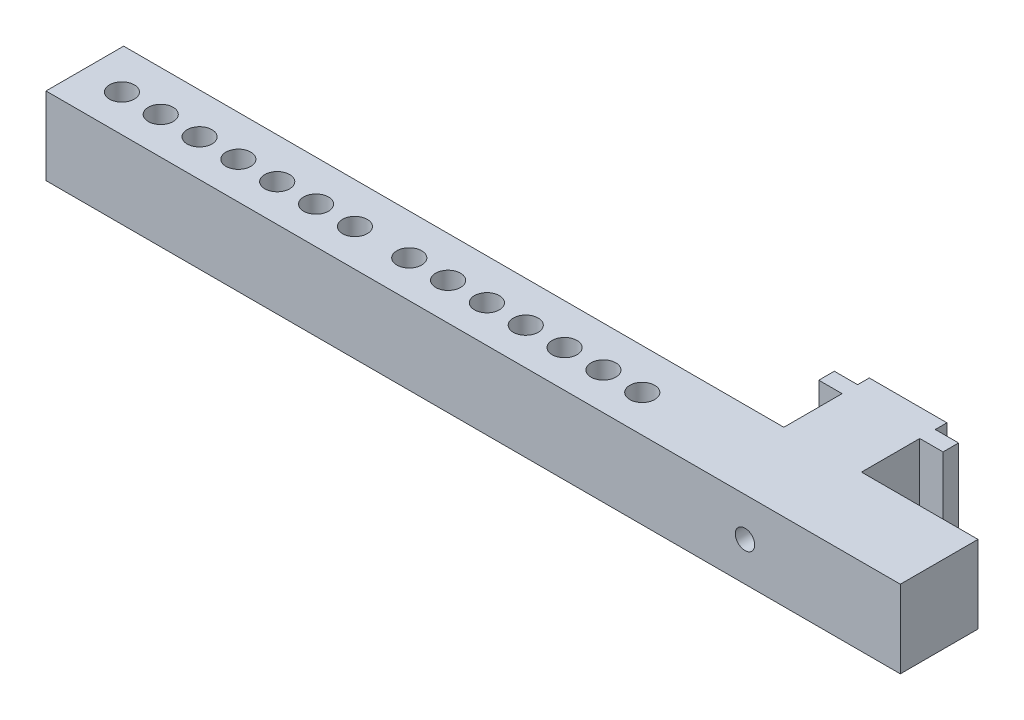
ISO-10303-21;
HEADER;
FILE_DESCRIPTION(('STEP AP214'),'2;1');
FILE_NAME('part.step','',(''),(''),'','','');
FILE_SCHEMA(('AUTOMOTIVE_DESIGN { 1 0 10303 214 1 1 1 1 }'));
ENDSEC;
DATA;
#1=APPLICATION_CONTEXT('core data for automotive mechanical design processes');
#2=APPLICATION_PROTOCOL_DEFINITION('international standard','automotive_design',2000,#1);
#3=PRODUCT_CONTEXT('',#1,'mechanical');
#4=PRODUCT('Part','Part','',(#3));
#5=PRODUCT_RELATED_PRODUCT_CATEGORY('part','',(#4));
#6=PRODUCT_DEFINITION_FORMATION('','',#4);
#7=PRODUCT_DEFINITION_CONTEXT('part definition',#1,'design');
#8=PRODUCT_DEFINITION('design','',#6,#7);
#9=PRODUCT_DEFINITION_SHAPE('','',#8);
#10=(LENGTH_UNIT() NAMED_UNIT(*) SI_UNIT(.MILLI.,.METRE.));
#11=(NAMED_UNIT(*) PLANE_ANGLE_UNIT() SI_UNIT($,.RADIAN.));
#12=(NAMED_UNIT(*) SI_UNIT($,.STERADIAN.) SOLID_ANGLE_UNIT());
#13=UNCERTAINTY_MEASURE_WITH_UNIT(LENGTH_MEASURE(1.E-05),#10,'distance_accuracy_value','');
#14=(GEOMETRIC_REPRESENTATION_CONTEXT(3) GLOBAL_UNCERTAINTY_ASSIGNED_CONTEXT((#13)) GLOBAL_UNIT_ASSIGNED_CONTEXT((#10,
#11,#12)) REPRESENTATION_CONTEXT('',''));
#15=CARTESIAN_POINT('',(0.,0.,0.));
#16=DIRECTION('',(0.,0.,1.));
#17=DIRECTION('',(1.,0.,0.));
#18=AXIS2_PLACEMENT_3D('',#15,#16,#17);
#19=CARTESIAN_POINT('',(5.,5.,11.));
#20=DIRECTION('',(-1.,0.,0.));
#21=DIRECTION('',(0.,0.,1.));
#22=AXIS2_PLACEMENT_3D('',#19,#20,#21);
#23=PLANE('',#22);
#24=DIRECTION('',(0.,0.,-1.));
#25=VECTOR('',#24,1.);
#26=CARTESIAN_POINT('',(5.,5.,11.));
#27=LINE('',#26,#25);
#28=CARTESIAN_POINT('',(5.,5.,1.5));
#29=VERTEX_POINT('',#28);
#30=CARTESIAN_POINT('',(5.,5.,0.));
#31=VERTEX_POINT('',#30);
#32=EDGE_CURVE('E41',#29,#31,#27,.T.);
#33=ORIENTED_EDGE('',*,*,#32,.F.);
#34=DIRECTION('',(0.,-1.,0.));
#35=VECTOR('',#34,1.);
#36=CARTESIAN_POINT('',(5.,5.,1.5));
#37=LINE('',#36,#35);
#38=CARTESIAN_POINT('',(5.,-5.,1.5));
#39=VERTEX_POINT('',#38);
#40=EDGE_CURVE('E247',#29,#39,#37,.T.);
#41=ORIENTED_EDGE('',*,*,#40,.T.);
#42=DIRECTION('',(0.,0.,-1.));
#43=VECTOR('',#42,1.);
#44=CARTESIAN_POINT('',(5.,-5.,11.));
#45=LINE('',#44,#43);
#46=CARTESIAN_POINT('',(5.,-5.,0.));
#47=VERTEX_POINT('',#46);
#48=EDGE_CURVE('E256',#39,#47,#45,.T.);
#49=ORIENTED_EDGE('',*,*,#48,.T.);
#50=DIRECTION('',(0.,1.,0.));
#51=VECTOR('',#50,1.);
#52=CARTESIAN_POINT('',(5.,5.,0.));
#53=LINE('',#52,#51);
#54=EDGE_CURVE('E250',#47,#31,#53,.T.);
#55=ORIENTED_EDGE('',*,*,#54,.T.);
#56=EDGE_LOOP('',(#33,#41,#49,#55));
#57=FACE_BOUND('',#56,.T.);
#58=ADVANCED_FACE('F33',(#57),#23,.F.);
#59=CARTESIAN_POINT('',(-5.,5.,11.));
#60=DIRECTION('',(1.,0.,0.));
#61=DIRECTION('',(0.,0.,-1.));
#62=AXIS2_PLACEMENT_3D('',#59,#60,#61);
#63=PLANE('',#62);
#64=DIRECTION('',(0.,0.,-1.));
#65=VECTOR('',#64,1.);
#66=CARTESIAN_POINT('',(-5.,-5.,11.));
#67=LINE('',#66,#65);
#68=CARTESIAN_POINT('',(-5.,-5.,1.5));
#69=VERTEX_POINT('',#68);
#70=CARTESIAN_POINT('',(-5.,-5.,0.));
#71=VERTEX_POINT('',#70);
#72=EDGE_CURVE('E270',#69,#71,#67,.T.);
#73=ORIENTED_EDGE('',*,*,#72,.F.);
#74=DIRECTION('',(0.,1.,0.));
#75=VECTOR('',#74,1.);
#76=CARTESIAN_POINT('',(-5.,5.,1.5));
#77=LINE('',#76,#75);
#78=CARTESIAN_POINT('',(-5.,5.,1.5));
#79=VERTEX_POINT('',#78);
#80=EDGE_CURVE('E244',#69,#79,#77,.T.);
#81=ORIENTED_EDGE('',*,*,#80,.T.);
#82=DIRECTION('',(0.,0.,-1.));
#83=VECTOR('',#82,1.);
#84=CARTESIAN_POINT('',(-5.,5.,11.));
#85=LINE('',#84,#83);
#86=CARTESIAN_POINT('',(-5.,5.,0.));
#87=VERTEX_POINT('',#86);
#88=EDGE_CURVE('E272',#79,#87,#85,.T.);
#89=ORIENTED_EDGE('',*,*,#88,.T.);
#90=DIRECTION('',(0.,-1.,0.));
#91=VECTOR('',#90,1.);
#92=CARTESIAN_POINT('',(-5.,5.,0.));
#93=LINE('',#92,#91);
#94=EDGE_CURVE('E262',#87,#71,#93,.T.);
#95=ORIENTED_EDGE('',*,*,#94,.T.);
#96=EDGE_LOOP('',(#73,#81,#89,#95));
#97=FACE_BOUND('',#96,.T.);
#98=ADVANCED_FACE('F274',(#97),#63,.F.);
#99=CARTESIAN_POINT('',(5.,-5.,11.));
#100=VERTEX_POINT('',#99);
#101=CARTESIAN_POINT('',(5.,-5.,3.5));
#102=VERTEX_POINT('',#101);
#103=EDGE_CURVE('E267',#100,#102,#45,.T.);
#104=ORIENTED_EDGE('',*,*,#103,.T.);
#105=DIRECTION('',(0.,1.,0.));
#106=VECTOR('',#105,1.);
#107=CARTESIAN_POINT('',(5.,5.,3.5));
#108=LINE('',#107,#106);
#109=CARTESIAN_POINT('',(5.,5.,3.5));
#110=VERTEX_POINT('',#109);
#111=EDGE_CURVE('E241',#102,#110,#108,.T.);
#112=ORIENTED_EDGE('',*,*,#111,.T.);
#113=CARTESIAN_POINT('',(5.,5.,11.));
#114=VERTEX_POINT('',#113);
#115=EDGE_CURVE('E11',#114,#110,#27,.T.);
#116=ORIENTED_EDGE('',*,*,#115,.F.);
#117=DIRECTION('',(0.,1.,0.));
#118=VECTOR('',#117,1.);
#119=CARTESIAN_POINT('',(5.,5.,11.));
#120=LINE('',#119,#118);
#121=EDGE_CURVE('E251',#100,#114,#120,.T.);
#122=ORIENTED_EDGE('',*,*,#121,.F.);
#123=EDGE_LOOP('',(#104,#112,#116,#122));
#124=FACE_BOUND('',#123,.T.);
#125=ADVANCED_FACE('F35',(#124),#23,.F.);
#126=CARTESIAN_POINT('',(-5.,5.,11.));
#127=DIRECTION('',(0.,-1.,0.));
#128=DIRECTION('',(0.,0.,-1.));
#129=AXIS2_PLACEMENT_3D('',#126,#127,#128);
#130=PLANE('',#129);
#131=CARTESIAN_POINT('',(-85.,5.,16.2291653565347));
#132=DIRECTION('',(0.,-1.,0.));
#133=DIRECTION('',(0.,0.,-1.));
#134=AXIS2_PLACEMENT_3D('',#131,#132,#133);
#135=CIRCLE('',#134,1.6);
#136=CARTESIAN_POINT('',(-85.,5.,14.6291653565347));
#137=VERTEX_POINT('',#136);
#138=EDGE_CURVE('E447',#137,#137,#135,.T.);
#139=ORIENTED_EDGE('',*,*,#138,.T.);
#140=EDGE_LOOP('',(#139));
#141=FACE_BOUND('',#140,.T.);
#142=CARTESIAN_POINT('',(-80.,5.,16.2291653565347));
#143=DIRECTION('',(0.,-1.,0.));
#144=DIRECTION('',(0.,0.,-1.));
#145=AXIS2_PLACEMENT_3D('',#142,#143,#144);
#146=CIRCLE('',#145,1.6);
#147=CARTESIAN_POINT('',(-80.,5.,14.6291653565347));
#148=VERTEX_POINT('',#147);
#149=EDGE_CURVE('E441',#148,#148,#146,.T.);
#150=ORIENTED_EDGE('',*,*,#149,.T.);
#151=EDGE_LOOP('',(#150));
#152=FACE_BOUND('',#151,.T.);
#153=CARTESIAN_POINT('',(-48.,5.,16.2291653565347));
#154=DIRECTION('',(0.,-1.,0.));
#155=DIRECTION('',(0.,0.,-1.));
#156=AXIS2_PLACEMENT_3D('',#153,#154,#155);
#157=CIRCLE('',#156,1.6);
#158=CARTESIAN_POINT('',(-48.,5.,14.6291653565347));
#159=VERTEX_POINT('',#158);
#160=EDGE_CURVE('E435',#159,#159,#157,.T.);
#161=ORIENTED_EDGE('',*,*,#160,.T.);
#162=EDGE_LOOP('',(#161));
#163=FACE_BOUND('',#162,.T.);
#164=CARTESIAN_POINT('',(-43.,5.,16.2291653565347));
#165=DIRECTION('',(0.,-1.,0.));
#166=DIRECTION('',(0.,0.,-1.));
#167=AXIS2_PLACEMENT_3D('',#164,#165,#166);
#168=CIRCLE('',#167,1.6);
#169=CARTESIAN_POINT('',(-43.,5.,14.6291653565347));
#170=VERTEX_POINT('',#169);
#171=EDGE_CURVE('E429',#170,#170,#168,.T.);
#172=ORIENTED_EDGE('',*,*,#171,.T.);
#173=EDGE_LOOP('',(#172));
#174=FACE_BOUND('',#173,.T.);
#175=CARTESIAN_POINT('',(-75.,5.,16.2291653565347));
#176=DIRECTION('',(0.,-1.,0.));
#177=DIRECTION('',(0.,0.,-1.));
#178=AXIS2_PLACEMENT_3D('',#175,#176,#177);
#179=CIRCLE('',#178,1.6);
#180=CARTESIAN_POINT('',(-75.,5.,14.6291653565347));
#181=VERTEX_POINT('',#180);
#182=EDGE_CURVE('E423',#181,#181,#179,.T.);
#183=ORIENTED_EDGE('',*,*,#182,.T.);
#184=EDGE_LOOP('',(#183));
#185=FACE_BOUND('',#184,.T.);
#186=CARTESIAN_POINT('',(-70.,5.,16.2291653565347));
#187=DIRECTION('',(0.,-1.,0.));
#188=DIRECTION('',(0.,0.,-1.));
#189=AXIS2_PLACEMENT_3D('',#186,#187,#188);
#190=CIRCLE('',#189,1.6);
#191=CARTESIAN_POINT('',(-70.,5.,14.6291653565347));
#192=VERTEX_POINT('',#191);
#193=EDGE_CURVE('E417',#192,#192,#190,.T.);
#194=ORIENTED_EDGE('',*,*,#193,.T.);
#195=EDGE_LOOP('',(#194));
#196=FACE_BOUND('',#195,.T.);
#197=CARTESIAN_POINT('',(-65.,5.,16.2291653565347));
#198=DIRECTION('',(0.,-1.,0.));
#199=DIRECTION('',(0.,0.,-1.));
#200=AXIS2_PLACEMENT_3D('',#197,#198,#199);
#201=CIRCLE('',#200,1.6);
#202=CARTESIAN_POINT('',(-65.,5.,14.6291653565347));
#203=VERTEX_POINT('',#202);
#204=EDGE_CURVE('E411',#203,#203,#201,.T.);
#205=ORIENTED_EDGE('',*,*,#204,.T.);
#206=EDGE_LOOP('',(#205));
#207=FACE_BOUND('',#206,.T.);
#208=CARTESIAN_POINT('',(-60.,5.,16.2291653565347));
#209=DIRECTION('',(0.,-1.,0.));
#210=DIRECTION('',(0.,0.,-1.));
#211=AXIS2_PLACEMENT_3D('',#208,#209,#210);
#212=CIRCLE('',#211,1.6);
#213=CARTESIAN_POINT('',(-60.,5.,14.6291653565347));
#214=VERTEX_POINT('',#213);
#215=EDGE_CURVE('E405',#214,#214,#212,.T.);
#216=ORIENTED_EDGE('',*,*,#215,.T.);
#217=EDGE_LOOP('',(#216));
#218=FACE_BOUND('',#217,.T.);
#219=CARTESIAN_POINT('',(-38.,5.,16.2291653565347));
#220=DIRECTION('',(0.,-1.,0.));
#221=DIRECTION('',(0.,0.,-1.));
#222=AXIS2_PLACEMENT_3D('',#219,#220,#221);
#223=CIRCLE('',#222,1.6);
#224=CARTESIAN_POINT('',(-38.,5.,14.6291653565347));
#225=VERTEX_POINT('',#224);
#226=EDGE_CURVE('E399',#225,#225,#223,.T.);
#227=ORIENTED_EDGE('',*,*,#226,.T.);
#228=EDGE_LOOP('',(#227));
#229=FACE_BOUND('',#228,.T.);
#230=CARTESIAN_POINT('',(-33.,5.,16.2291653565347));
#231=DIRECTION('',(0.,-1.,0.));
#232=DIRECTION('',(0.,0.,-1.));
#233=AXIS2_PLACEMENT_3D('',#230,#231,#232);
#234=CIRCLE('',#233,1.6);
#235=CARTESIAN_POINT('',(-33.,5.,14.6291653565347));
#236=VERTEX_POINT('',#235);
#237=EDGE_CURVE('E393',#236,#236,#234,.T.);
#238=ORIENTED_EDGE('',*,*,#237,.T.);
#239=EDGE_LOOP('',(#238));
#240=FACE_BOUND('',#239,.T.);
#241=CARTESIAN_POINT('',(-28.,5.,16.2291653565347));
#242=DIRECTION('',(0.,-1.,0.));
#243=DIRECTION('',(0.,0.,-1.));
#244=AXIS2_PLACEMENT_3D('',#241,#242,#243);
#245=CIRCLE('',#244,1.6);
#246=CARTESIAN_POINT('',(-28.,5.,14.6291653565347));
#247=VERTEX_POINT('',#246);
#248=EDGE_CURVE('E387',#247,#247,#245,.T.);
#249=ORIENTED_EDGE('',*,*,#248,.T.);
#250=EDGE_LOOP('',(#249));
#251=FACE_BOUND('',#250,.T.);
#252=CARTESIAN_POINT('',(-23.,5.,16.2291653565347));
#253=DIRECTION('',(0.,-1.,0.));
#254=DIRECTION('',(0.,0.,-1.));
#255=AXIS2_PLACEMENT_3D('',#252,#253,#254);
#256=CIRCLE('',#255,1.6);
#257=CARTESIAN_POINT('',(-23.,5.,14.6291653565347));
#258=VERTEX_POINT('',#257);
#259=EDGE_CURVE('E381',#258,#258,#256,.T.);
#260=ORIENTED_EDGE('',*,*,#259,.T.);
#261=EDGE_LOOP('',(#260));
#262=FACE_BOUND('',#261,.T.);
#263=CARTESIAN_POINT('',(-55.,5.,16.2291653565347));
#264=DIRECTION('',(0.,-1.,0.));
#265=DIRECTION('',(0.,0.,-1.));
#266=AXIS2_PLACEMENT_3D('',#263,#264,#265);
#267=CIRCLE('',#266,1.6);
#268=CARTESIAN_POINT('',(-55.,5.,14.6291653565347));
#269=VERTEX_POINT('',#268);
#270=EDGE_CURVE('E375',#269,#269,#267,.T.);
#271=ORIENTED_EDGE('',*,*,#270,.T.);
#272=EDGE_LOOP('',(#271));
#273=FACE_BOUND('',#272,.T.);
#274=CARTESIAN_POINT('',(-18.,5.,16.2291653565347));
#275=DIRECTION('',(0.,-1.,0.));
#276=DIRECTION('',(0.,0.,-1.));
#277=AXIS2_PLACEMENT_3D('',#274,#275,#276);
#278=CIRCLE('',#277,1.6);
#279=CARTESIAN_POINT('',(-18.,5.,14.6291653565347));
#280=VERTEX_POINT('',#279);
#281=EDGE_CURVE('E368',#280,#280,#278,.T.);
#282=ORIENTED_EDGE('',*,*,#281,.T.);
#283=EDGE_LOOP('',(#282));
#284=FACE_BOUND('',#283,.T.);
#285=ORIENTED_EDGE('',*,*,#115,.T.);
#286=DIRECTION('',(1.,0.,0.));
#287=VECTOR('',#286,1.);
#288=CARTESIAN_POINT('',(-8.,5.,3.5));
#289=LINE('',#288,#287);
#290=CARTESIAN_POINT('',(8.,5.,3.5));
#291=VERTEX_POINT('',#290);
#292=EDGE_CURVE('E236',#110,#291,#289,.T.);
#293=ORIENTED_EDGE('',*,*,#292,.T.);
#294=DIRECTION('',(0.,0.,1.));
#295=VECTOR('',#294,1.);
#296=CARTESIAN_POINT('',(8.,5.,3.5));
#297=LINE('',#296,#295);
#298=CARTESIAN_POINT('',(8.,5.,1.5));
#299=VERTEX_POINT('',#298);
#300=EDGE_CURVE('E203',#299,#291,#297,.T.);
#301=ORIENTED_EDGE('',*,*,#300,.F.);
#302=DIRECTION('',(1.,0.,0.));
#303=VECTOR('',#302,1.);
#304=CARTESIAN_POINT('',(-8.,5.,1.5));
#305=LINE('',#304,#303);
#306=EDGE_CURVE('E48',#29,#299,#305,.T.);
#307=ORIENTED_EDGE('',*,*,#306,.F.);
#308=ORIENTED_EDGE('',*,*,#32,.T.);
#309=DIRECTION('',(-1.,0.,0.));
#310=VECTOR('',#309,1.);
#311=CARTESIAN_POINT('',(-5.,5.,0.));
#312=LINE('',#311,#310);
#313=EDGE_CURVE('E259',#31,#87,#312,.T.);
#314=ORIENTED_EDGE('',*,*,#313,.T.);
#315=ORIENTED_EDGE('',*,*,#88,.F.);
#316=CARTESIAN_POINT('',(-8.,5.,1.5));
#317=VERTEX_POINT('',#316);
#318=EDGE_CURVE('E237',#317,#79,#305,.T.);
#319=ORIENTED_EDGE('',*,*,#318,.F.);
#320=DIRECTION('',(0.,0.,1.));
#321=VECTOR('',#320,1.);
#322=CARTESIAN_POINT('',(-8.,5.,3.5));
#323=LINE('',#322,#321);
#324=CARTESIAN_POINT('',(-8.,5.,3.5));
#325=VERTEX_POINT('',#324);
#326=EDGE_CURVE('E215',#317,#325,#323,.T.);
#327=ORIENTED_EDGE('',*,*,#326,.T.);
#328=CARTESIAN_POINT('',(-5.,5.,3.5));
#329=VERTEX_POINT('',#328);
#330=EDGE_CURVE('E233',#325,#329,#289,.T.);
#331=ORIENTED_EDGE('',*,*,#330,.T.);
#332=CARTESIAN_POINT('',(-5.,5.,11.));
#333=VERTEX_POINT('',#332);
#334=EDGE_CURVE('E56',#333,#329,#85,.T.);
#335=ORIENTED_EDGE('',*,*,#334,.F.);
#336=DIRECTION('',(-1.,0.,0.));
#337=VECTOR('',#336,1.);
#338=CARTESIAN_POINT('',(-20.,5.,11.));
#339=LINE('',#338,#337);
#340=CARTESIAN_POINT('',(-90.,5.,11.));
#341=VERTEX_POINT('',#340);
#342=EDGE_CURVE('E191',#333,#341,#339,.T.);
#343=ORIENTED_EDGE('',*,*,#342,.T.);
#344=DIRECTION('',(0.,0.,-1.));
#345=VECTOR('',#344,1.);
#346=CARTESIAN_POINT('',(-90.,5.,21.));
#347=LINE('',#346,#345);
#348=CARTESIAN_POINT('',(-90.,5.,21.));
#349=VERTEX_POINT('',#348);
#350=EDGE_CURVE('E172',#349,#341,#347,.T.);
#351=ORIENTED_EDGE('',*,*,#350,.F.);
#352=DIRECTION('',(-1.,0.,0.));
#353=VECTOR('',#352,1.);
#354=CARTESIAN_POINT('',(-20.,5.,21.));
#355=LINE('',#354,#353);
#356=CARTESIAN_POINT('',(20.,5.,21.));
#357=VERTEX_POINT('',#356);
#358=EDGE_CURVE('E185',#357,#349,#355,.T.);
#359=ORIENTED_EDGE('',*,*,#358,.F.);
#360=DIRECTION('',(0.,0.,-1.));
#361=VECTOR('',#360,1.);
#362=CARTESIAN_POINT('',(20.,5.,21.));
#363=LINE('',#362,#361);
#364=CARTESIAN_POINT('',(20.,5.,11.));
#365=VERTEX_POINT('',#364);
#366=EDGE_CURVE('E197',#357,#365,#363,.T.);
#367=ORIENTED_EDGE('',*,*,#366,.T.);
#368=EDGE_CURVE('E192',#365,#114,#339,.T.);
#369=ORIENTED_EDGE('',*,*,#368,.T.);
#370=EDGE_LOOP('',(#285,#293,#301,#307,#308,#314,#315,#319,#327,#331,#335,#343,#351,#359,#367,#369));
#371=FACE_BOUND('',#370,.T.);
#372=ADVANCED_FACE('F279',(#141,#152,#163,#174,#185,#196,#207,#218,#229,#240,#251,#262,#273,
#284,#371),#130,.F.);
#373=ORIENTED_EDGE('',*,*,#334,.T.);
#374=DIRECTION('',(0.,-1.,0.));
#375=VECTOR('',#374,1.);
#376=CARTESIAN_POINT('',(-5.,5.,3.5));
#377=LINE('',#376,#375);
#378=CARTESIAN_POINT('',(-5.,-5.,3.5));
#379=VERTEX_POINT('',#378);
#380=EDGE_CURVE('E227',#329,#379,#377,.T.);
#381=ORIENTED_EDGE('',*,*,#380,.T.);
#382=CARTESIAN_POINT('',(-5.,-5.,11.));
#383=VERTEX_POINT('',#382);
#384=EDGE_CURVE('E271',#383,#379,#67,.T.);
#385=ORIENTED_EDGE('',*,*,#384,.F.);
#386=DIRECTION('',(0.,-1.,0.));
#387=VECTOR('',#386,1.);
#388=CARTESIAN_POINT('',(-5.,5.,11.));
#389=LINE('',#388,#387);
#390=EDGE_CURVE('E153',#333,#383,#389,.T.);
#391=ORIENTED_EDGE('',*,*,#390,.F.);
#392=EDGE_LOOP('',(#373,#381,#385,#391));
#393=FACE_BOUND('',#392,.T.);
#394=ADVANCED_FACE('F295',(#393),#63,.F.);
#395=CARTESIAN_POINT('',(-5.,-5.,11.));
#396=DIRECTION('',(0.,1.,0.));
#397=DIRECTION('',(0.,0.,1.));
#398=AXIS2_PLACEMENT_3D('',#395,#396,#397);
#399=PLANE('',#398);
#400=CARTESIAN_POINT('',(-85.,-5.,16.2291653565347));
#401=DIRECTION('',(0.,-1.,0.));
#402=DIRECTION('',(0.,0.,-1.));
#403=AXIS2_PLACEMENT_3D('',#400,#401,#402);
#404=CIRCLE('',#403,1.59999999999999);
#405=CARTESIAN_POINT('',(-85.,-5.,14.6291653565347));
#406=VERTEX_POINT('',#405);
#407=EDGE_CURVE('E450',#406,#406,#404,.T.);
#408=ORIENTED_EDGE('',*,*,#407,.F.);
#409=EDGE_LOOP('',(#408));
#410=FACE_BOUND('',#409,.T.);
#411=CARTESIAN_POINT('',(-80.,-5.,16.2291653565347));
#412=DIRECTION('',(0.,-1.,0.));
#413=DIRECTION('',(0.,0.,-1.));
#414=AXIS2_PLACEMENT_3D('',#411,#412,#413);
#415=CIRCLE('',#414,1.59999999999999);
#416=CARTESIAN_POINT('',(-80.,-5.,14.6291653565347));
#417=VERTEX_POINT('',#416);
#418=EDGE_CURVE('E444',#417,#417,#415,.T.);
#419=ORIENTED_EDGE('',*,*,#418,.F.);
#420=EDGE_LOOP('',(#419));
#421=FACE_BOUND('',#420,.T.);
#422=CARTESIAN_POINT('',(-48.,-5.,16.2291653565347));
#423=DIRECTION('',(0.,-1.,0.));
#424=DIRECTION('',(0.,0.,-1.));
#425=AXIS2_PLACEMENT_3D('',#422,#423,#424);
#426=CIRCLE('',#425,1.59999999999998);
#427=CARTESIAN_POINT('',(-48.,-5.,14.6291653565348));
#428=VERTEX_POINT('',#427);
#429=EDGE_CURVE('E438',#428,#428,#426,.T.);
#430=ORIENTED_EDGE('',*,*,#429,.F.);
#431=EDGE_LOOP('',(#430));
#432=FACE_BOUND('',#431,.T.);
#433=CARTESIAN_POINT('',(-43.,-5.,16.2291653565347));
#434=DIRECTION('',(0.,-1.,0.));
#435=DIRECTION('',(0.,0.,-1.));
#436=AXIS2_PLACEMENT_3D('',#433,#434,#435);
#437=CIRCLE('',#436,1.59999999999999);
#438=CARTESIAN_POINT('',(-43.,-5.,14.6291653565347));
#439=VERTEX_POINT('',#438);
#440=EDGE_CURVE('E432',#439,#439,#437,.T.);
#441=ORIENTED_EDGE('',*,*,#440,.F.);
#442=EDGE_LOOP('',(#441));
#443=FACE_BOUND('',#442,.T.);
#444=CARTESIAN_POINT('',(-75.,-5.,16.2291653565347));
#445=DIRECTION('',(0.,-1.,0.));
#446=DIRECTION('',(0.,0.,-1.));
#447=AXIS2_PLACEMENT_3D('',#444,#445,#446);
#448=CIRCLE('',#447,1.59999999999999);
#449=CARTESIAN_POINT('',(-75.,-5.,14.6291653565347));
#450=VERTEX_POINT('',#449);
#451=EDGE_CURVE('E426',#450,#450,#448,.T.);
#452=ORIENTED_EDGE('',*,*,#451,.F.);
#453=EDGE_LOOP('',(#452));
#454=FACE_BOUND('',#453,.T.);
#455=CARTESIAN_POINT('',(-70.,-5.,16.2291653565347));
#456=DIRECTION('',(0.,-1.,0.));
#457=DIRECTION('',(0.,0.,-1.));
#458=AXIS2_PLACEMENT_3D('',#455,#456,#457);
#459=CIRCLE('',#458,1.59999999999999);
#460=CARTESIAN_POINT('',(-70.,-5.,14.6291653565347));
#461=VERTEX_POINT('',#460);
#462=EDGE_CURVE('E420',#461,#461,#459,.T.);
#463=ORIENTED_EDGE('',*,*,#462,.F.);
#464=EDGE_LOOP('',(#463));
#465=FACE_BOUND('',#464,.T.);
#466=CARTESIAN_POINT('',(-65.,-5.,16.2291653565347));
#467=DIRECTION('',(0.,-1.,0.));
#468=DIRECTION('',(0.,0.,-1.));
#469=AXIS2_PLACEMENT_3D('',#466,#467,#468);
#470=CIRCLE('',#469,1.59999999999999);
#471=CARTESIAN_POINT('',(-65.,-5.,14.6291653565347));
#472=VERTEX_POINT('',#471);
#473=EDGE_CURVE('E414',#472,#472,#470,.T.);
#474=ORIENTED_EDGE('',*,*,#473,.F.);
#475=EDGE_LOOP('',(#474));
#476=FACE_BOUND('',#475,.T.);
#477=CARTESIAN_POINT('',(-60.,-5.,16.2291653565347));
#478=DIRECTION('',(0.,-1.,0.));
#479=DIRECTION('',(0.,0.,-1.));
#480=AXIS2_PLACEMENT_3D('',#477,#478,#479);
#481=CIRCLE('',#480,1.59999999999998);
#482=CARTESIAN_POINT('',(-60.,-5.,14.6291653565348));
#483=VERTEX_POINT('',#482);
#484=EDGE_CURVE('E408',#483,#483,#481,.T.);
#485=ORIENTED_EDGE('',*,*,#484,.F.);
#486=EDGE_LOOP('',(#485));
#487=FACE_BOUND('',#486,.T.);
#488=CARTESIAN_POINT('',(-38.,-5.,16.2291653565347));
#489=DIRECTION('',(0.,-1.,0.));
#490=DIRECTION('',(0.,0.,-1.));
#491=AXIS2_PLACEMENT_3D('',#488,#489,#490);
#492=CIRCLE('',#491,1.59999999999998);
#493=CARTESIAN_POINT('',(-38.,-5.,14.6291653565348));
#494=VERTEX_POINT('',#493);
#495=EDGE_CURVE('E402',#494,#494,#492,.T.);
#496=ORIENTED_EDGE('',*,*,#495,.F.);
#497=EDGE_LOOP('',(#496));
#498=FACE_BOUND('',#497,.T.);
#499=CARTESIAN_POINT('',(-33.,-5.,16.2291653565347));
#500=DIRECTION('',(0.,-1.,0.));
#501=DIRECTION('',(0.,0.,-1.));
#502=AXIS2_PLACEMENT_3D('',#499,#500,#501);
#503=CIRCLE('',#502,1.59999999999999);
#504=CARTESIAN_POINT('',(-33.,-5.,14.6291653565347));
#505=VERTEX_POINT('',#504);
#506=EDGE_CURVE('E396',#505,#505,#503,.T.);
#507=ORIENTED_EDGE('',*,*,#506,.F.);
#508=EDGE_LOOP('',(#507));
#509=FACE_BOUND('',#508,.T.);
#510=CARTESIAN_POINT('',(-28.,-5.,16.2291653565347));
#511=DIRECTION('',(0.,-1.,0.));
#512=DIRECTION('',(0.,0.,-1.));
#513=AXIS2_PLACEMENT_3D('',#510,#511,#512);
#514=CIRCLE('',#513,1.59999999999999);
#515=CARTESIAN_POINT('',(-28.,-5.,14.6291653565347));
#516=VERTEX_POINT('',#515);
#517=EDGE_CURVE('E390',#516,#516,#514,.T.);
#518=ORIENTED_EDGE('',*,*,#517,.F.);
#519=EDGE_LOOP('',(#518));
#520=FACE_BOUND('',#519,.T.);
#521=CARTESIAN_POINT('',(-23.,-5.,16.2291653565347));
#522=DIRECTION('',(0.,-1.,0.));
#523=DIRECTION('',(0.,0.,-1.));
#524=AXIS2_PLACEMENT_3D('',#521,#522,#523);
#525=CIRCLE('',#524,1.59999999999999);
#526=CARTESIAN_POINT('',(-23.,-5.,14.6291653565347));
#527=VERTEX_POINT('',#526);
#528=EDGE_CURVE('E384',#527,#527,#525,.T.);
#529=ORIENTED_EDGE('',*,*,#528,.F.);
#530=EDGE_LOOP('',(#529));
#531=FACE_BOUND('',#530,.T.);
#532=CARTESIAN_POINT('',(-55.,-5.,16.2291653565347));
#533=DIRECTION('',(0.,-1.,0.));
#534=DIRECTION('',(0.,0.,-1.));
#535=AXIS2_PLACEMENT_3D('',#532,#533,#534);
#536=CIRCLE('',#535,1.59999999999999);
#537=CARTESIAN_POINT('',(-55.,-5.,14.6291653565347));
#538=VERTEX_POINT('',#537);
#539=EDGE_CURVE('E378',#538,#538,#536,.T.);
#540=ORIENTED_EDGE('',*,*,#539,.F.);
#541=EDGE_LOOP('',(#540));
#542=FACE_BOUND('',#541,.T.);
#543=CARTESIAN_POINT('',(-18.,-5.,16.2291653565347));
#544=DIRECTION('',(0.,-1.,0.));
#545=DIRECTION('',(0.,0.,-1.));
#546=AXIS2_PLACEMENT_3D('',#543,#544,#545);
#547=CIRCLE('',#546,1.59999999999999);
#548=CARTESIAN_POINT('',(-18.,-5.,14.6291653565347));
#549=VERTEX_POINT('',#548);
#550=EDGE_CURVE('E370',#549,#549,#547,.T.);
#551=ORIENTED_EDGE('',*,*,#550,.F.);
#552=EDGE_LOOP('',(#551));
#553=FACE_BOUND('',#552,.T.);
#554=ORIENTED_EDGE('',*,*,#384,.T.);
#555=DIRECTION('',(1.,0.,0.));
#556=VECTOR('',#555,1.);
#557=CARTESIAN_POINT('',(-8.,-5.,3.5));
#558=LINE('',#557,#556);
#559=CARTESIAN_POINT('',(-8.,-5.,3.5));
#560=VERTEX_POINT('',#559);
#561=EDGE_CURVE('E229',#560,#379,#558,.T.);
#562=ORIENTED_EDGE('',*,*,#561,.F.);
#563=DIRECTION('',(0.,0.,-1.));
#564=VECTOR('',#563,1.);
#565=CARTESIAN_POINT('',(-8.,-5.,3.5));
#566=LINE('',#565,#564);
#567=CARTESIAN_POINT('',(-8.,-5.,1.5));
#568=VERTEX_POINT('',#567);
#569=EDGE_CURVE('E221',#560,#568,#566,.T.);
#570=ORIENTED_EDGE('',*,*,#569,.T.);
#571=DIRECTION('',(1.,0.,0.));
#572=VECTOR('',#571,1.);
#573=CARTESIAN_POINT('',(-8.,-5.,1.5));
#574=LINE('',#573,#572);
#575=EDGE_CURVE('E224',#568,#69,#574,.T.);
#576=ORIENTED_EDGE('',*,*,#575,.T.);
#577=ORIENTED_EDGE('',*,*,#72,.T.);
#578=DIRECTION('',(1.,0.,0.));
#579=VECTOR('',#578,1.);
#580=CARTESIAN_POINT('',(-5.,-5.,0.));
#581=LINE('',#580,#579);
#582=EDGE_CURVE('E254',#71,#47,#581,.T.);
#583=ORIENTED_EDGE('',*,*,#582,.T.);
#584=ORIENTED_EDGE('',*,*,#48,.F.);
#585=CARTESIAN_POINT('',(8.,-5.,1.5));
#586=VERTEX_POINT('',#585);
#587=EDGE_CURVE('E228',#39,#586,#574,.T.);
#588=ORIENTED_EDGE('',*,*,#587,.T.);
#589=DIRECTION('',(0.,0.,-1.));
#590=VECTOR('',#589,1.);
#591=CARTESIAN_POINT('',(8.,-5.,3.5));
#592=LINE('',#591,#590);
#593=CARTESIAN_POINT('',(8.,-5.,3.5));
#594=VERTEX_POINT('',#593);
#595=EDGE_CURVE('E209',#594,#586,#592,.T.);
#596=ORIENTED_EDGE('',*,*,#595,.F.);
#597=EDGE_CURVE('E232',#102,#594,#558,.T.);
#598=ORIENTED_EDGE('',*,*,#597,.F.);
#599=ORIENTED_EDGE('',*,*,#103,.F.);
#600=DIRECTION('',(1.,0.,0.));
#601=VECTOR('',#600,1.);
#602=CARTESIAN_POINT('',(-20.,-5.,11.));
#603=LINE('',#602,#601);
#604=CARTESIAN_POINT('',(20.,-5.,11.));
#605=VERTEX_POINT('',#604);
#606=EDGE_CURVE('E157',#100,#605,#603,.T.);
#607=ORIENTED_EDGE('',*,*,#606,.T.);
#608=DIRECTION('',(0.,0.,-1.));
#609=VECTOR('',#608,1.);
#610=CARTESIAN_POINT('',(20.,-5.,21.));
#611=LINE('',#610,#609);
#612=CARTESIAN_POINT('',(20.,-5.,21.));
#613=VERTEX_POINT('',#612);
#614=EDGE_CURVE('E188',#613,#605,#611,.T.);
#615=ORIENTED_EDGE('',*,*,#614,.F.);
#616=DIRECTION('',(1.,0.,0.));
#617=VECTOR('',#616,1.);
#618=CARTESIAN_POINT('',(-20.,-5.,21.));
#619=LINE('',#618,#617);
#620=CARTESIAN_POINT('',(-90.,-5.,21.));
#621=VERTEX_POINT('',#620);
#622=EDGE_CURVE('E163',#621,#613,#619,.T.);
#623=ORIENTED_EDGE('',*,*,#622,.F.);
#624=DIRECTION('',(0.,0.,1.));
#625=VECTOR('',#624,1.);
#626=CARTESIAN_POINT('',(-90.,-5.,21.));
#627=LINE('',#626,#625);
#628=CARTESIAN_POINT('',(-90.,-5.,11.));
#629=VERTEX_POINT('',#628);
#630=EDGE_CURVE('E160',#629,#621,#627,.T.);
#631=ORIENTED_EDGE('',*,*,#630,.F.);
#632=EDGE_CURVE('E147',#629,#383,#603,.T.);
#633=ORIENTED_EDGE('',*,*,#632,.T.);
#634=EDGE_LOOP('',(#554,#562,#570,#576,#577,#583,#584,#588,#596,#598,#599,#607,#615,#623,#631,#633));
#635=FACE_BOUND('',#634,.T.);
#636=ADVANCED_FACE('F161',(#410,#421,#432,#443,#454,#465,#476,#487,#498,#509,#520,#531,#542,
#553,#635),#399,.F.);
#637=CARTESIAN_POINT('',(0.,0.,0.));
#638=DIRECTION('',(0.,0.,1.));
#639=DIRECTION('',(1.,0.,0.));
#640=AXIS2_PLACEMENT_3D('',#637,#638,#639);
#641=PLANE('',#640);
#642=CARTESIAN_POINT('',(0.,0.,0.));
#643=DIRECTION('',(0.,0.,1.));
#644=DIRECTION('',(1.,0.,0.));
#645=AXIS2_PLACEMENT_3D('',#642,#643,#644);
#646=CIRCLE('',#645,1.25);
#647=CARTESIAN_POINT('',(1.25,0.,0.));
#648=VERTEX_POINT('',#647);
#649=EDGE_CURVE('E173',#648,#648,#646,.T.);
#650=ORIENTED_EDGE('',*,*,#649,.T.);
#651=EDGE_LOOP('',(#650));
#652=FACE_BOUND('',#651,.T.);
#653=ORIENTED_EDGE('',*,*,#54,.F.);
#654=ORIENTED_EDGE('',*,*,#582,.F.);
#655=ORIENTED_EDGE('',*,*,#94,.F.);
#656=ORIENTED_EDGE('',*,*,#313,.F.);
#657=EDGE_LOOP('',(#653,#654,#655,#656));
#658=FACE_BOUND('',#657,.T.);
#659=ADVANCED_FACE('F283',(#652,#658),#641,.F.);
#660=CARTESIAN_POINT('',(-8.,0.,0.));
#661=DIRECTION('',(1.,0.,0.));
#662=DIRECTION('',(0.,0.,-1.));
#663=AXIS2_PLACEMENT_3D('',#660,#661,#662);
#664=PLANE('',#663);
#665=DIRECTION('',(0.,1.,0.));
#666=VECTOR('',#665,1.);
#667=CARTESIAN_POINT('',(-8.,5.,1.5));
#668=LINE('',#667,#666);
#669=EDGE_CURVE('E212',#568,#317,#668,.T.);
#670=ORIENTED_EDGE('',*,*,#669,.F.);
#671=ORIENTED_EDGE('',*,*,#569,.F.);
#672=DIRECTION('',(0.,-1.,0.));
#673=VECTOR('',#672,1.);
#674=CARTESIAN_POINT('',(-8.,5.,3.5));
#675=LINE('',#674,#673);
#676=EDGE_CURVE('E218',#325,#560,#675,.T.);
#677=ORIENTED_EDGE('',*,*,#676,.F.);
#678=ORIENTED_EDGE('',*,*,#326,.F.);
#679=EDGE_LOOP('',(#670,#671,#677,#678));
#680=FACE_BOUND('',#679,.T.);
#681=ADVANCED_FACE('F291',(#680),#664,.F.);
#682=CARTESIAN_POINT('',(-8.,5.,3.5));
#683=DIRECTION('',(0.,0.,1.));
#684=DIRECTION('',(1.,0.,0.));
#685=AXIS2_PLACEMENT_3D('',#682,#683,#684);
#686=PLANE('',#685);
#687=ORIENTED_EDGE('',*,*,#380,.F.);
#688=ORIENTED_EDGE('',*,*,#330,.F.);
#689=ORIENTED_EDGE('',*,*,#676,.T.);
#690=ORIENTED_EDGE('',*,*,#561,.T.);
#691=EDGE_LOOP('',(#687,#688,#689,#690));
#692=FACE_BOUND('',#691,.T.);
#693=ADVANCED_FACE('F294',(#692),#686,.T.);
#694=CARTESIAN_POINT('',(-8.,5.,1.5));
#695=DIRECTION('',(0.,0.,-1.));
#696=DIRECTION('',(-1.,0.,0.));
#697=AXIS2_PLACEMENT_3D('',#694,#695,#696);
#698=PLANE('',#697);
#699=ORIENTED_EDGE('',*,*,#80,.F.);
#700=ORIENTED_EDGE('',*,*,#575,.F.);
#701=ORIENTED_EDGE('',*,*,#669,.T.);
#702=ORIENTED_EDGE('',*,*,#318,.T.);
#703=EDGE_LOOP('',(#699,#700,#701,#702));
#704=FACE_BOUND('',#703,.T.);
#705=ADVANCED_FACE('F286',(#704),#698,.T.);
#706=ORIENTED_EDGE('',*,*,#40,.F.);
#707=ORIENTED_EDGE('',*,*,#306,.T.);
#708=DIRECTION('',(0.,1.,0.));
#709=VECTOR('',#708,1.);
#710=CARTESIAN_POINT('',(8.,5.,1.5));
#711=LINE('',#710,#709);
#712=EDGE_CURVE('E200',#586,#299,#711,.T.);
#713=ORIENTED_EDGE('',*,*,#712,.F.);
#714=ORIENTED_EDGE('',*,*,#587,.F.);
#715=EDGE_LOOP('',(#706,#707,#713,#714));
#716=FACE_BOUND('',#715,.T.);
#717=ADVANCED_FACE('F354',(#716),#698,.T.);
#718=ORIENTED_EDGE('',*,*,#111,.F.);
#719=ORIENTED_EDGE('',*,*,#597,.T.);
#720=DIRECTION('',(0.,-1.,0.));
#721=VECTOR('',#720,1.);
#722=CARTESIAN_POINT('',(8.,5.,3.5));
#723=LINE('',#722,#721);
#724=EDGE_CURVE('E206',#291,#594,#723,.T.);
#725=ORIENTED_EDGE('',*,*,#724,.F.);
#726=ORIENTED_EDGE('',*,*,#292,.F.);
#727=EDGE_LOOP('',(#718,#719,#725,#726));
#728=FACE_BOUND('',#727,.T.);
#729=ADVANCED_FACE('F320',(#728),#686,.T.);
#730=CARTESIAN_POINT('',(8.,0.,0.));
#731=DIRECTION('',(1.,0.,0.));
#732=DIRECTION('',(0.,0.,-1.));
#733=AXIS2_PLACEMENT_3D('',#730,#731,#732);
#734=PLANE('',#733);
#735=ORIENTED_EDGE('',*,*,#712,.T.);
#736=ORIENTED_EDGE('',*,*,#300,.T.);
#737=ORIENTED_EDGE('',*,*,#724,.T.);
#738=ORIENTED_EDGE('',*,*,#595,.T.);
#739=EDGE_LOOP('',(#735,#736,#737,#738));
#740=FACE_BOUND('',#739,.T.);
#741=ADVANCED_FACE('F322',(#740),#734,.T.);
#742=CARTESIAN_POINT('',(0.,0.,11.));
#743=DIRECTION('',(0.,0.,1.));
#744=DIRECTION('',(1.,0.,0.));
#745=AXIS2_PLACEMENT_3D('',#742,#743,#744);
#746=PLANE('',#745);
#747=ORIENTED_EDGE('',*,*,#606,.F.);
#748=ORIENTED_EDGE('',*,*,#121,.T.);
#749=ORIENTED_EDGE('',*,*,#368,.F.);
#750=DIRECTION('',(0.,1.,0.));
#751=VECTOR('',#750,1.);
#752=CARTESIAN_POINT('',(20.,5.,11.));
#753=LINE('',#752,#751);
#754=EDGE_CURVE('E182',#605,#365,#753,.T.);
#755=ORIENTED_EDGE('',*,*,#754,.F.);
#756=EDGE_LOOP('',(#747,#748,#749,#755));
#757=FACE_BOUND('',#756,.T.);
#758=ADVANCED_FACE('F325',(#757),#746,.F.);
#759=ORIENTED_EDGE('',*,*,#342,.F.);
#760=ORIENTED_EDGE('',*,*,#390,.T.);
#761=ORIENTED_EDGE('',*,*,#632,.F.);
#762=DIRECTION('',(0.,-1.,0.));
#763=VECTOR('',#762,1.);
#764=CARTESIAN_POINT('',(-90.,-5.,11.));
#765=LINE('',#764,#763);
#766=EDGE_CURVE('E152',#341,#629,#765,.T.);
#767=ORIENTED_EDGE('',*,*,#766,.F.);
#768=EDGE_LOOP('',(#759,#760,#761,#767));
#769=FACE_BOUND('',#768,.T.);
#770=ADVANCED_FACE('F150',(#769),#746,.F.);
#771=CARTESIAN_POINT('',(20.,5.,21.));
#772=DIRECTION('',(-1.,0.,0.));
#773=DIRECTION('',(0.,0.,1.));
#774=AXIS2_PLACEMENT_3D('',#771,#772,#773);
#775=PLANE('',#774);
#776=ORIENTED_EDGE('',*,*,#754,.T.);
#777=ORIENTED_EDGE('',*,*,#366,.F.);
#778=DIRECTION('',(0.,1.,0.));
#779=VECTOR('',#778,1.);
#780=CARTESIAN_POINT('',(20.,5.,21.));
#781=LINE('',#780,#779);
#782=EDGE_CURVE('E156',#613,#357,#781,.T.);
#783=ORIENTED_EDGE('',*,*,#782,.F.);
#784=ORIENTED_EDGE('',*,*,#614,.T.);
#785=EDGE_LOOP('',(#776,#777,#783,#784));
#786=FACE_BOUND('',#785,.T.);
#787=ADVANCED_FACE('F329',(#786),#775,.F.);
#788=CARTESIAN_POINT('',(0.,0.,21.));
#789=DIRECTION('',(0.,0.,1.));
#790=DIRECTION('',(1.,0.,0.));
#791=AXIS2_PLACEMENT_3D('',#788,#789,#790);
#792=PLANE('',#791);
#793=CARTESIAN_POINT('',(0.,0.,21.));
#794=DIRECTION('',(0.,0.,1.));
#795=DIRECTION('',(1.,0.,0.));
#796=AXIS2_PLACEMENT_3D('',#793,#794,#795);
#797=CIRCLE('',#796,1.24999999999999);
#798=CARTESIAN_POINT('',(1.24999999999999,0.,21.));
#799=VERTEX_POINT('',#798);
#800=EDGE_CURVE('E176',#799,#799,#797,.T.);
#801=ORIENTED_EDGE('',*,*,#800,.F.);
#802=EDGE_LOOP('',(#801));
#803=FACE_BOUND('',#802,.T.);
#804=ORIENTED_EDGE('',*,*,#782,.T.);
#805=ORIENTED_EDGE('',*,*,#358,.T.);
#806=DIRECTION('',(0.,1.,0.));
#807=VECTOR('',#806,1.);
#808=CARTESIAN_POINT('',(-90.,-5.,21.));
#809=LINE('',#808,#807);
#810=EDGE_CURVE('E167',#621,#349,#809,.T.);
#811=ORIENTED_EDGE('',*,*,#810,.F.);
#812=ORIENTED_EDGE('',*,*,#622,.T.);
#813=EDGE_LOOP('',(#804,#805,#811,#812));
#814=FACE_BOUND('',#813,.T.);
#815=ADVANCED_FACE('F332',(#803,#814),#792,.T.);
#816=CARTESIAN_POINT('',(-90.,0.,0.));
#817=DIRECTION('',(-1.,0.,0.));
#818=DIRECTION('',(0.,0.,1.));
#819=AXIS2_PLACEMENT_3D('',#816,#817,#818);
#820=PLANE('',#819);
#821=ORIENTED_EDGE('',*,*,#766,.T.);
#822=ORIENTED_EDGE('',*,*,#630,.T.);
#823=ORIENTED_EDGE('',*,*,#810,.T.);
#824=ORIENTED_EDGE('',*,*,#350,.T.);
#825=EDGE_LOOP('',(#821,#822,#823,#824));
#826=FACE_BOUND('',#825,.T.);
#827=ADVANCED_FACE('F170',(#826),#820,.T.);
#828=CARTESIAN_POINT('',(0.,0.,21.));
#829=DIRECTION('',(0.,0.,1.));
#830=DIRECTION('',(1.,0.,0.));
#831=AXIS2_PLACEMENT_3D('',#828,#829,#830);
#832=CYLINDRICAL_SURFACE('',#831,1.24999999999999);
#833=ORIENTED_EDGE('',*,*,#649,.F.);
#834=EDGE_LOOP('',(#833));
#835=FACE_BOUND('',#834,.T.);
#836=ORIENTED_EDGE('',*,*,#800,.T.);
#837=EDGE_LOOP('',(#836));
#838=FACE_BOUND('',#837,.T.);
#839=ADVANCED_FACE('F340',(#835,#838),#832,.F.);
#840=CARTESIAN_POINT('',(-18.,-5.,16.2291653565347));
#841=DIRECTION('',(0.,-1.,0.));
#842=DIRECTION('',(0.,0.,-1.));
#843=AXIS2_PLACEMENT_3D('',#840,#841,#842);
#844=CYLINDRICAL_SURFACE('',#843,1.59999999999999);
#845=ORIENTED_EDGE('',*,*,#281,.F.);
#846=EDGE_LOOP('',(#845));
#847=FACE_BOUND('',#846,.T.);
#848=ORIENTED_EDGE('',*,*,#550,.T.);
#849=EDGE_LOOP('',(#848));
#850=FACE_BOUND('',#849,.T.);
#851=ADVANCED_FACE('F366',(#847,#850),#844,.F.);
#852=CARTESIAN_POINT('',(-55.,-5.,16.2291653565347));
#853=DIRECTION('',(0.,-1.,0.));
#854=DIRECTION('',(0.,0.,-1.));
#855=AXIS2_PLACEMENT_3D('',#852,#853,#854);
#856=CYLINDRICAL_SURFACE('',#855,1.59999999999999);
#857=ORIENTED_EDGE('',*,*,#270,.F.);
#858=EDGE_LOOP('',(#857));
#859=FACE_BOUND('',#858,.T.);
#860=ORIENTED_EDGE('',*,*,#539,.T.);
#861=EDGE_LOOP('',(#860));
#862=FACE_BOUND('',#861,.T.);
#863=ADVANCED_FACE('F483',(#859,#862),#856,.F.);
#864=CARTESIAN_POINT('',(-23.,-5.,16.2291653565347));
#865=DIRECTION('',(0.,-1.,0.));
#866=DIRECTION('',(0.,0.,-1.));
#867=AXIS2_PLACEMENT_3D('',#864,#865,#866);
#868=CYLINDRICAL_SURFACE('',#867,1.59999999999999);
#869=ORIENTED_EDGE('',*,*,#259,.F.);
#870=EDGE_LOOP('',(#869));
#871=FACE_BOUND('',#870,.T.);
#872=ORIENTED_EDGE('',*,*,#528,.T.);
#873=EDGE_LOOP('',(#872));
#874=FACE_BOUND('',#873,.T.);
#875=ADVANCED_FACE('F489',(#871,#874),#868,.F.);
#876=CARTESIAN_POINT('',(-28.,-5.,16.2291653565347));
#877=DIRECTION('',(0.,-1.,0.));
#878=DIRECTION('',(0.,0.,-1.));
#879=AXIS2_PLACEMENT_3D('',#876,#877,#878);
#880=CYLINDRICAL_SURFACE('',#879,1.59999999999999);
#881=ORIENTED_EDGE('',*,*,#248,.F.);
#882=EDGE_LOOP('',(#881));
#883=FACE_BOUND('',#882,.T.);
#884=ORIENTED_EDGE('',*,*,#517,.T.);
#885=EDGE_LOOP('',(#884));
#886=FACE_BOUND('',#885,.T.);
#887=ADVANCED_FACE('F496',(#883,#886),#880,.F.);
#888=CARTESIAN_POINT('',(-33.,-5.,16.2291653565347));
#889=DIRECTION('',(0.,-1.,0.));
#890=DIRECTION('',(0.,0.,-1.));
#891=AXIS2_PLACEMENT_3D('',#888,#889,#890);
#892=CYLINDRICAL_SURFACE('',#891,1.59999999999999);
#893=ORIENTED_EDGE('',*,*,#237,.F.);
#894=EDGE_LOOP('',(#893));
#895=FACE_BOUND('',#894,.T.);
#896=ORIENTED_EDGE('',*,*,#506,.T.);
#897=EDGE_LOOP('',(#896));
#898=FACE_BOUND('',#897,.T.);
#899=ADVANCED_FACE('F500',(#895,#898),#892,.F.);
#900=CARTESIAN_POINT('',(-38.,-5.,16.2291653565347));
#901=DIRECTION('',(0.,-1.,0.));
#902=DIRECTION('',(0.,0.,-1.));
#903=AXIS2_PLACEMENT_3D('',#900,#901,#902);
#904=CYLINDRICAL_SURFACE('',#903,1.59999999999999);
#905=ORIENTED_EDGE('',*,*,#226,.F.);
#906=EDGE_LOOP('',(#905));
#907=FACE_BOUND('',#906,.T.);
#908=ORIENTED_EDGE('',*,*,#495,.T.);
#909=EDGE_LOOP('',(#908));
#910=FACE_BOUND('',#909,.T.);
#911=ADVANCED_FACE('F504',(#907,#910),#904,.F.);
#912=CARTESIAN_POINT('',(-60.,-5.,16.2291653565347));
#913=DIRECTION('',(0.,-1.,0.));
#914=DIRECTION('',(0.,0.,-1.));
#915=AXIS2_PLACEMENT_3D('',#912,#913,#914);
#916=CYLINDRICAL_SURFACE('',#915,1.59999999999999);
#917=ORIENTED_EDGE('',*,*,#215,.F.);
#918=EDGE_LOOP('',(#917));
#919=FACE_BOUND('',#918,.T.);
#920=ORIENTED_EDGE('',*,*,#484,.T.);
#921=EDGE_LOOP('',(#920));
#922=FACE_BOUND('',#921,.T.);
#923=ADVANCED_FACE('F508',(#919,#922),#916,.F.);
#924=CARTESIAN_POINT('',(-65.,-5.,16.2291653565347));
#925=DIRECTION('',(0.,-1.,0.));
#926=DIRECTION('',(0.,0.,-1.));
#927=AXIS2_PLACEMENT_3D('',#924,#925,#926);
#928=CYLINDRICAL_SURFACE('',#927,1.6);
#929=ORIENTED_EDGE('',*,*,#204,.F.);
#930=EDGE_LOOP('',(#929));
#931=FACE_BOUND('',#930,.T.);
#932=ORIENTED_EDGE('',*,*,#473,.T.);
#933=EDGE_LOOP('',(#932));
#934=FACE_BOUND('',#933,.T.);
#935=ADVANCED_FACE('F512',(#931,#934),#928,.F.);
#936=CARTESIAN_POINT('',(-70.,-5.,16.2291653565347));
#937=DIRECTION('',(0.,-1.,0.));
#938=DIRECTION('',(0.,0.,-1.));
#939=AXIS2_PLACEMENT_3D('',#936,#937,#938);
#940=CYLINDRICAL_SURFACE('',#939,1.6);
#941=ORIENTED_EDGE('',*,*,#193,.F.);
#942=EDGE_LOOP('',(#941));
#943=FACE_BOUND('',#942,.T.);
#944=ORIENTED_EDGE('',*,*,#462,.T.);
#945=EDGE_LOOP('',(#944));
#946=FACE_BOUND('',#945,.T.);
#947=ADVANCED_FACE('F516',(#943,#946),#940,.F.);
#948=CARTESIAN_POINT('',(-75.,-5.,16.2291653565347));
#949=DIRECTION('',(0.,-1.,0.));
#950=DIRECTION('',(0.,0.,-1.));
#951=AXIS2_PLACEMENT_3D('',#948,#949,#950);
#952=CYLINDRICAL_SURFACE('',#951,1.6);
#953=ORIENTED_EDGE('',*,*,#182,.F.);
#954=EDGE_LOOP('',(#953));
#955=FACE_BOUND('',#954,.T.);
#956=ORIENTED_EDGE('',*,*,#451,.T.);
#957=EDGE_LOOP('',(#956));
#958=FACE_BOUND('',#957,.T.);
#959=ADVANCED_FACE('F520',(#955,#958),#952,.F.);
#960=CARTESIAN_POINT('',(-43.,-5.,16.2291653565347));
#961=DIRECTION('',(0.,-1.,0.));
#962=DIRECTION('',(0.,0.,-1.));
#963=AXIS2_PLACEMENT_3D('',#960,#961,#962);
#964=CYLINDRICAL_SURFACE('',#963,1.59999999999999);
#965=ORIENTED_EDGE('',*,*,#171,.F.);
#966=EDGE_LOOP('',(#965));
#967=FACE_BOUND('',#966,.T.);
#968=ORIENTED_EDGE('',*,*,#440,.T.);
#969=EDGE_LOOP('',(#968));
#970=FACE_BOUND('',#969,.T.);
#971=ADVANCED_FACE('F524',(#967,#970),#964,.F.);
#972=CARTESIAN_POINT('',(-48.,-5.,16.2291653565347));
#973=DIRECTION('',(0.,-1.,0.));
#974=DIRECTION('',(0.,0.,-1.));
#975=AXIS2_PLACEMENT_3D('',#972,#973,#974);
#976=CYLINDRICAL_SURFACE('',#975,1.59999999999999);
#977=ORIENTED_EDGE('',*,*,#160,.F.);
#978=EDGE_LOOP('',(#977));
#979=FACE_BOUND('',#978,.T.);
#980=ORIENTED_EDGE('',*,*,#429,.T.);
#981=EDGE_LOOP('',(#980));
#982=FACE_BOUND('',#981,.T.);
#983=ADVANCED_FACE('F528',(#979,#982),#976,.F.);
#984=CARTESIAN_POINT('',(-80.,-5.,16.2291653565347));
#985=DIRECTION('',(0.,-1.,0.));
#986=DIRECTION('',(0.,0.,-1.));
#987=AXIS2_PLACEMENT_3D('',#984,#985,#986);
#988=CYLINDRICAL_SURFACE('',#987,1.6);
#989=ORIENTED_EDGE('',*,*,#149,.F.);
#990=EDGE_LOOP('',(#989));
#991=FACE_BOUND('',#990,.T.);
#992=ORIENTED_EDGE('',*,*,#418,.T.);
#993=EDGE_LOOP('',(#992));
#994=FACE_BOUND('',#993,.T.);
#995=ADVANCED_FACE('F532',(#991,#994),#988,.F.);
#996=CARTESIAN_POINT('',(-85.,-5.,16.2291653565347));
#997=DIRECTION('',(0.,-1.,0.));
#998=DIRECTION('',(0.,0.,-1.));
#999=AXIS2_PLACEMENT_3D('',#996,#997,#998);
#1000=CYLINDRICAL_SURFACE('',#999,1.6);
#1001=ORIENTED_EDGE('',*,*,#138,.F.);
#1002=EDGE_LOOP('',(#1001));
#1003=FACE_BOUND('',#1002,.T.);
#1004=ORIENTED_EDGE('',*,*,#407,.T.);
#1005=EDGE_LOOP('',(#1004));
#1006=FACE_BOUND('',#1005,.T.);
#1007=ADVANCED_FACE('F454',(#1003,#1006),#1000,.F.);
#1008=CLOSED_SHELL('',(#58,#98,#125,#372,#394,#636,#659,#681,#693,#705,#717,#729,#741,#758,#770,
#787,#815,#827,#839,#851,#863,#875,#887,#899,#911,#923,#935,#947,#959,#971,#983,#995,#1007));
#1009=MANIFOLD_SOLID_BREP('B2',#1008);
#1010=ADVANCED_BREP_SHAPE_REPRESENTATION('',(#18,#1009),#14);
#1011=SHAPE_DEFINITION_REPRESENTATION(#9,#1010);
ENDSEC;
END-ISO-10303-21;
